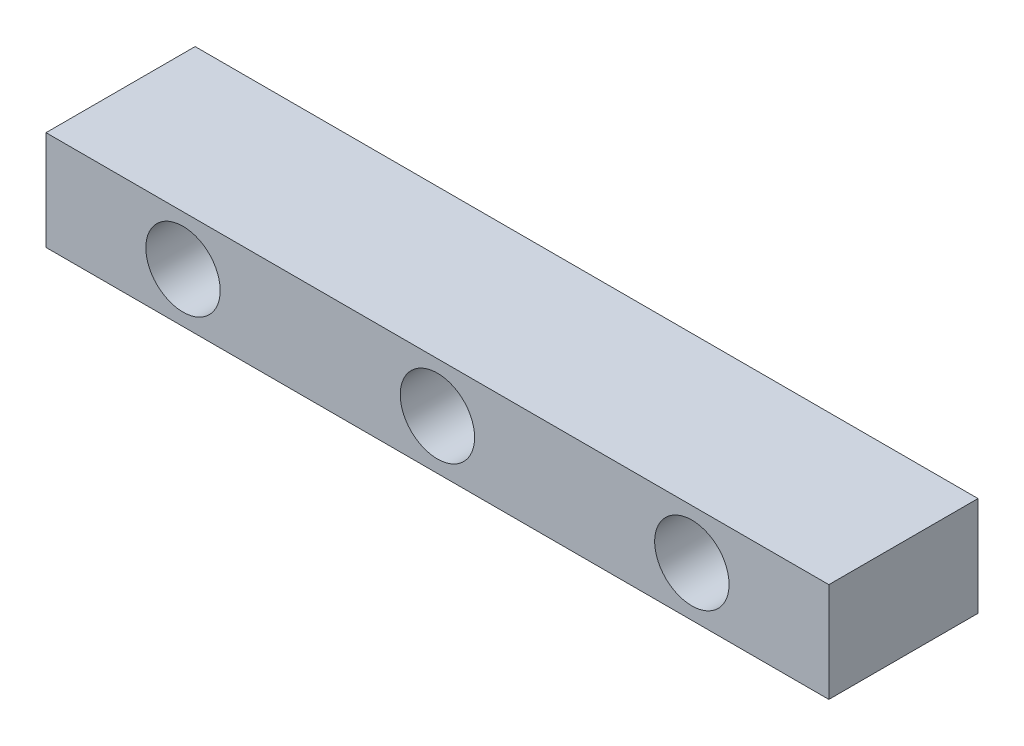
ISO-10303-21;
HEADER;
FILE_DESCRIPTION(('STEP AP214'),'2;1');
FILE_NAME('part.step','',(''),(''),'','','');
FILE_SCHEMA(('AUTOMOTIVE_DESIGN { 1 0 10303 214 1 1 1 1 }'));
ENDSEC;
DATA;
#1=APPLICATION_CONTEXT('core data for automotive mechanical design processes');
#2=APPLICATION_PROTOCOL_DEFINITION('international standard','automotive_design',2000,#1);
#3=PRODUCT_CONTEXT('',#1,'mechanical');
#4=PRODUCT('Part','Part','',(#3));
#5=PRODUCT_RELATED_PRODUCT_CATEGORY('part','',(#4));
#6=PRODUCT_DEFINITION_FORMATION('','',#4);
#7=PRODUCT_DEFINITION_CONTEXT('part definition',#1,'design');
#8=PRODUCT_DEFINITION('design','',#6,#7);
#9=PRODUCT_DEFINITION_SHAPE('','',#8);
#10=(LENGTH_UNIT() NAMED_UNIT(*) SI_UNIT(.MILLI.,.METRE.));
#11=(NAMED_UNIT(*) PLANE_ANGLE_UNIT() SI_UNIT($,.RADIAN.));
#12=(NAMED_UNIT(*) SI_UNIT($,.STERADIAN.) SOLID_ANGLE_UNIT());
#13=UNCERTAINTY_MEASURE_WITH_UNIT(LENGTH_MEASURE(1.E-05),#10,'distance_accuracy_value','');
#14=(GEOMETRIC_REPRESENTATION_CONTEXT(3) GLOBAL_UNCERTAINTY_ASSIGNED_CONTEXT((#13)) GLOBAL_UNIT_ASSIGNED_CONTEXT((#10,
#11,#12)) REPRESENTATION_CONTEXT('',''));
#15=CARTESIAN_POINT('',(0.,0.,0.));
#16=DIRECTION('',(0.,0.,1.));
#17=DIRECTION('',(1.,0.,0.));
#18=AXIS2_PLACEMENT_3D('',#15,#16,#17);
#19=CARTESIAN_POINT('',(0.,50.8,0.));
#20=DIRECTION('',(1.,0.,0.));
#21=DIRECTION('',(0.,0.,-1.));
#22=AXIS2_PLACEMENT_3D('',#19,#20,#21);
#23=PLANE('',#22);
#24=DIRECTION('',(0.,0.,1.));
#25=VECTOR('',#24,1.);
#26=CARTESIAN_POINT('',(0.,0.,0.));
#27=LINE('',#26,#25);
#28=CARTESIAN_POINT('',(0.,0.,-76.2));
#29=VERTEX_POINT('',#28);
#30=CARTESIAN_POINT('',(0.,0.,0.));
#31=VERTEX_POINT('',#30);
#32=EDGE_CURVE('E93',#29,#31,#27,.T.);
#33=ORIENTED_EDGE('',*,*,#32,.T.);
#34=DIRECTION('',(0.,-1.,0.));
#35=VECTOR('',#34,1.);
#36=CARTESIAN_POINT('',(0.,50.8,0.));
#37=LINE('',#36,#35);
#38=CARTESIAN_POINT('',(0.,50.8,0.));
#39=VERTEX_POINT('',#38);
#40=EDGE_CURVE('E11',#39,#31,#37,.T.);
#41=ORIENTED_EDGE('',*,*,#40,.F.);
#42=DIRECTION('',(0.,0.,1.));
#43=VECTOR('',#42,1.);
#44=CARTESIAN_POINT('',(0.,50.8,0.));
#45=LINE('',#44,#43);
#46=CARTESIAN_POINT('',(0.,50.8,-76.2));
#47=VERTEX_POINT('',#46);
#48=EDGE_CURVE('E81',#47,#39,#45,.T.);
#49=ORIENTED_EDGE('',*,*,#48,.F.);
#50=DIRECTION('',(0.,-1.,0.));
#51=VECTOR('',#50,1.);
#52=CARTESIAN_POINT('',(0.,50.8,-76.2));
#53=LINE('',#52,#51);
#54=EDGE_CURVE('E89',#47,#29,#53,.T.);
#55=ORIENTED_EDGE('',*,*,#54,.T.);
#56=EDGE_LOOP('',(#33,#41,#49,#55));
#57=FACE_BOUND('',#56,.T.);
#58=ADVANCED_FACE('F30',(#57),#23,.F.);
#59=CARTESIAN_POINT('',(0.,50.8,0.));
#60=DIRECTION('',(0.,0.,-1.));
#61=DIRECTION('',(-1.,0.,0.));
#62=AXIS2_PLACEMENT_3D('',#59,#60,#61);
#63=PLANE('',#62);
#64=CARTESIAN_POINT('',(330.,25.4,0.));
#65=DIRECTION('',(0.,0.,1.));
#66=DIRECTION('',(1.,0.,0.));
#67=AXIS2_PLACEMENT_3D('',#64,#65,#66);
#68=CIRCLE('',#67,19.);
#69=CARTESIAN_POINT('',(349.,25.4,0.));
#70=VERTEX_POINT('',#69);
#71=EDGE_CURVE('E116',#70,#70,#68,.T.);
#72=ORIENTED_EDGE('',*,*,#71,.F.);
#73=EDGE_LOOP('',(#72));
#74=FACE_BOUND('',#73,.T.);
#75=CARTESIAN_POINT('',(200.,25.4,0.));
#76=DIRECTION('',(0.,0.,1.));
#77=DIRECTION('',(1.,0.,0.));
#78=AXIS2_PLACEMENT_3D('',#75,#76,#77);
#79=CIRCLE('',#78,19.);
#80=CARTESIAN_POINT('',(219.,25.4,0.));
#81=VERTEX_POINT('',#80);
#82=EDGE_CURVE('E110',#81,#81,#79,.T.);
#83=ORIENTED_EDGE('',*,*,#82,.F.);
#84=EDGE_LOOP('',(#83));
#85=FACE_BOUND('',#84,.T.);
#86=CARTESIAN_POINT('',(70.,25.4,0.));
#87=DIRECTION('',(0.,0.,1.));
#88=DIRECTION('',(1.,0.,0.));
#89=AXIS2_PLACEMENT_3D('',#86,#87,#88);
#90=CIRCLE('',#89,19.);
#91=CARTESIAN_POINT('',(89.,25.4,0.));
#92=VERTEX_POINT('',#91);
#93=EDGE_CURVE('E107',#92,#92,#90,.T.);
#94=ORIENTED_EDGE('',*,*,#93,.F.);
#95=EDGE_LOOP('',(#94));
#96=FACE_BOUND('',#95,.T.);
#97=DIRECTION('',(1.,0.,0.));
#98=VECTOR('',#97,1.);
#99=CARTESIAN_POINT('',(0.,0.,0.));
#100=LINE('',#99,#98);
#101=CARTESIAN_POINT('',(400.,0.,0.));
#102=VERTEX_POINT('',#101);
#103=EDGE_CURVE('E85',#31,#102,#100,.T.);
#104=ORIENTED_EDGE('',*,*,#103,.T.);
#105=DIRECTION('',(0.,-1.,0.));
#106=VECTOR('',#105,1.);
#107=CARTESIAN_POINT('',(400.,50.8,0.));
#108=LINE('',#107,#106);
#109=CARTESIAN_POINT('',(400.,50.8,0.));
#110=VERTEX_POINT('',#109);
#111=EDGE_CURVE('E38',#110,#102,#108,.T.);
#112=ORIENTED_EDGE('',*,*,#111,.F.);
#113=DIRECTION('',(1.,0.,0.));
#114=VECTOR('',#113,1.);
#115=CARTESIAN_POINT('',(0.,50.8,0.));
#116=LINE('',#115,#114);
#117=EDGE_CURVE('E76',#39,#110,#116,.T.);
#118=ORIENTED_EDGE('',*,*,#117,.F.);
#119=ORIENTED_EDGE('',*,*,#40,.T.);
#120=EDGE_LOOP('',(#104,#112,#118,#119));
#121=FACE_BOUND('',#120,.T.);
#122=ADVANCED_FACE('F84',(#74,#85,#96,#121),#63,.F.);
#123=CARTESIAN_POINT('',(400.,50.8,0.));
#124=DIRECTION('',(-1.,0.,0.));
#125=DIRECTION('',(0.,0.,1.));
#126=AXIS2_PLACEMENT_3D('',#123,#124,#125);
#127=PLANE('',#126);
#128=DIRECTION('',(0.,0.,-1.));
#129=VECTOR('',#128,1.);
#130=CARTESIAN_POINT('',(400.,0.,0.));
#131=LINE('',#130,#129);
#132=CARTESIAN_POINT('',(400.,0.,-76.2));
#133=VERTEX_POINT('',#132);
#134=EDGE_CURVE('E63',#102,#133,#131,.T.);
#135=ORIENTED_EDGE('',*,*,#134,.T.);
#136=DIRECTION('',(0.,-1.,0.));
#137=VECTOR('',#136,1.);
#138=CARTESIAN_POINT('',(400.,50.8,-76.2));
#139=LINE('',#138,#137);
#140=CARTESIAN_POINT('',(400.,50.8,-76.2));
#141=VERTEX_POINT('',#140);
#142=EDGE_CURVE('E86',#141,#133,#139,.T.);
#143=ORIENTED_EDGE('',*,*,#142,.F.);
#144=DIRECTION('',(0.,0.,-1.));
#145=VECTOR('',#144,1.);
#146=CARTESIAN_POINT('',(400.,50.8,0.));
#147=LINE('',#146,#145);
#148=EDGE_CURVE('E79',#110,#141,#147,.T.);
#149=ORIENTED_EDGE('',*,*,#148,.F.);
#150=ORIENTED_EDGE('',*,*,#111,.T.);
#151=EDGE_LOOP('',(#135,#143,#149,#150));
#152=FACE_BOUND('',#151,.T.);
#153=ADVANCED_FACE('F87',(#152),#127,.F.);
#154=CARTESIAN_POINT('',(0.,50.8,-76.2));
#155=DIRECTION('',(0.,0.,1.));
#156=DIRECTION('',(1.,0.,0.));
#157=AXIS2_PLACEMENT_3D('',#154,#155,#156);
#158=PLANE('',#157);
#159=CARTESIAN_POINT('',(330.,25.4,-76.2));
#160=DIRECTION('',(0.,0.,1.));
#161=DIRECTION('',(1.,0.,0.));
#162=AXIS2_PLACEMENT_3D('',#159,#160,#161);
#163=CIRCLE('',#162,19.);
#164=CARTESIAN_POINT('',(349.,25.4,-76.2));
#165=VERTEX_POINT('',#164);
#166=EDGE_CURVE('E119',#165,#165,#163,.T.);
#167=ORIENTED_EDGE('',*,*,#166,.T.);
#168=EDGE_LOOP('',(#167));
#169=FACE_BOUND('',#168,.T.);
#170=CARTESIAN_POINT('',(200.,25.4,-76.2));
#171=DIRECTION('',(0.,0.,1.));
#172=DIRECTION('',(1.,0.,0.));
#173=AXIS2_PLACEMENT_3D('',#170,#171,#172);
#174=CIRCLE('',#173,19.);
#175=CARTESIAN_POINT('',(219.,25.4,-76.2));
#176=VERTEX_POINT('',#175);
#177=EDGE_CURVE('E113',#176,#176,#174,.T.);
#178=ORIENTED_EDGE('',*,*,#177,.T.);
#179=EDGE_LOOP('',(#178));
#180=FACE_BOUND('',#179,.T.);
#181=CARTESIAN_POINT('',(70.,25.4,-76.2));
#182=DIRECTION('',(0.,0.,1.));
#183=DIRECTION('',(1.,0.,0.));
#184=AXIS2_PLACEMENT_3D('',#181,#182,#183);
#185=CIRCLE('',#184,19.);
#186=CARTESIAN_POINT('',(89.,25.4,-76.2));
#187=VERTEX_POINT('',#186);
#188=EDGE_CURVE('E96',#187,#187,#185,.T.);
#189=ORIENTED_EDGE('',*,*,#188,.T.);
#190=EDGE_LOOP('',(#189));
#191=FACE_BOUND('',#190,.T.);
#192=DIRECTION('',(-1.,0.,0.));
#193=VECTOR('',#192,1.);
#194=CARTESIAN_POINT('',(0.,0.,-76.2));
#195=LINE('',#194,#193);
#196=EDGE_CURVE('E69',#133,#29,#195,.T.);
#197=ORIENTED_EDGE('',*,*,#196,.T.);
#198=ORIENTED_EDGE('',*,*,#54,.F.);
#199=DIRECTION('',(-1.,0.,0.));
#200=VECTOR('',#199,1.);
#201=CARTESIAN_POINT('',(0.,50.8,-76.2));
#202=LINE('',#201,#200);
#203=EDGE_CURVE('E46',#141,#47,#202,.T.);
#204=ORIENTED_EDGE('',*,*,#203,.F.);
#205=ORIENTED_EDGE('',*,*,#142,.T.);
#206=EDGE_LOOP('',(#197,#198,#204,#205));
#207=FACE_BOUND('',#206,.T.);
#208=ADVANCED_FACE('F101',(#169,#180,#191,#207),#158,.F.);
#209=CARTESIAN_POINT('',(0.,50.8,-76.2));
#210=DIRECTION('',(0.,-1.,0.));
#211=DIRECTION('',(0.,0.,-1.));
#212=AXIS2_PLACEMENT_3D('',#209,#210,#211);
#213=PLANE('',#212);
#214=ORIENTED_EDGE('',*,*,#48,.T.);
#215=ORIENTED_EDGE('',*,*,#117,.T.);
#216=ORIENTED_EDGE('',*,*,#148,.T.);
#217=ORIENTED_EDGE('',*,*,#203,.T.);
#218=EDGE_LOOP('',(#214,#215,#216,#217));
#219=FACE_BOUND('',#218,.T.);
#220=ADVANCED_FACE('F77',(#219),#213,.F.);
#221=CARTESIAN_POINT('',(0.,0.,-76.2));
#222=DIRECTION('',(0.,-1.,0.));
#223=DIRECTION('',(0.,0.,-1.));
#224=AXIS2_PLACEMENT_3D('',#221,#222,#223);
#225=PLANE('',#224);
#226=ORIENTED_EDGE('',*,*,#32,.F.);
#227=ORIENTED_EDGE('',*,*,#196,.F.);
#228=ORIENTED_EDGE('',*,*,#134,.F.);
#229=ORIENTED_EDGE('',*,*,#103,.F.);
#230=EDGE_LOOP('',(#226,#227,#228,#229));
#231=FACE_BOUND('',#230,.T.);
#232=ADVANCED_FACE('F104',(#231),#225,.T.);
#233=CARTESIAN_POINT('',(70.,25.4,-76.2));
#234=DIRECTION('',(0.,0.,1.));
#235=DIRECTION('',(1.,0.,0.));
#236=AXIS2_PLACEMENT_3D('',#233,#234,#235);
#237=CYLINDRICAL_SURFACE('',#236,19.);
#238=ORIENTED_EDGE('',*,*,#188,.F.);
#239=EDGE_LOOP('',(#238));
#240=FACE_BOUND('',#239,.T.);
#241=ORIENTED_EDGE('',*,*,#93,.T.);
#242=EDGE_LOOP('',(#241));
#243=FACE_BOUND('',#242,.T.);
#244=ADVANCED_FACE('F133',(#240,#243),#237,.F.);
#245=CARTESIAN_POINT('',(200.,25.4,-76.2));
#246=DIRECTION('',(0.,0.,1.));
#247=DIRECTION('',(1.,0.,0.));
#248=AXIS2_PLACEMENT_3D('',#245,#246,#247);
#249=CYLINDRICAL_SURFACE('',#248,19.);
#250=ORIENTED_EDGE('',*,*,#177,.F.);
#251=EDGE_LOOP('',(#250));
#252=FACE_BOUND('',#251,.T.);
#253=ORIENTED_EDGE('',*,*,#82,.T.);
#254=EDGE_LOOP('',(#253));
#255=FACE_BOUND('',#254,.T.);
#256=ADVANCED_FACE('F135',(#252,#255),#249,.F.);
#257=CARTESIAN_POINT('',(330.,25.4,-76.2));
#258=DIRECTION('',(0.,0.,1.));
#259=DIRECTION('',(1.,0.,0.));
#260=AXIS2_PLACEMENT_3D('',#257,#258,#259);
#261=CYLINDRICAL_SURFACE('',#260,19.);
#262=ORIENTED_EDGE('',*,*,#166,.F.);
#263=EDGE_LOOP('',(#262));
#264=FACE_BOUND('',#263,.T.);
#265=ORIENTED_EDGE('',*,*,#71,.T.);
#266=EDGE_LOOP('',(#265));
#267=FACE_BOUND('',#266,.T.);
#268=ADVANCED_FACE('F125',(#264,#267),#261,.F.);
#269=CLOSED_SHELL('',(#58,#122,#153,#208,#220,#232,#244,#256,#268));
#270=MANIFOLD_SOLID_BREP('B2',#269);
#271=ADVANCED_BREP_SHAPE_REPRESENTATION('',(#18,#270),#14);
#272=SHAPE_DEFINITION_REPRESENTATION(#9,#271);
ENDSEC;
END-ISO-10303-21;
